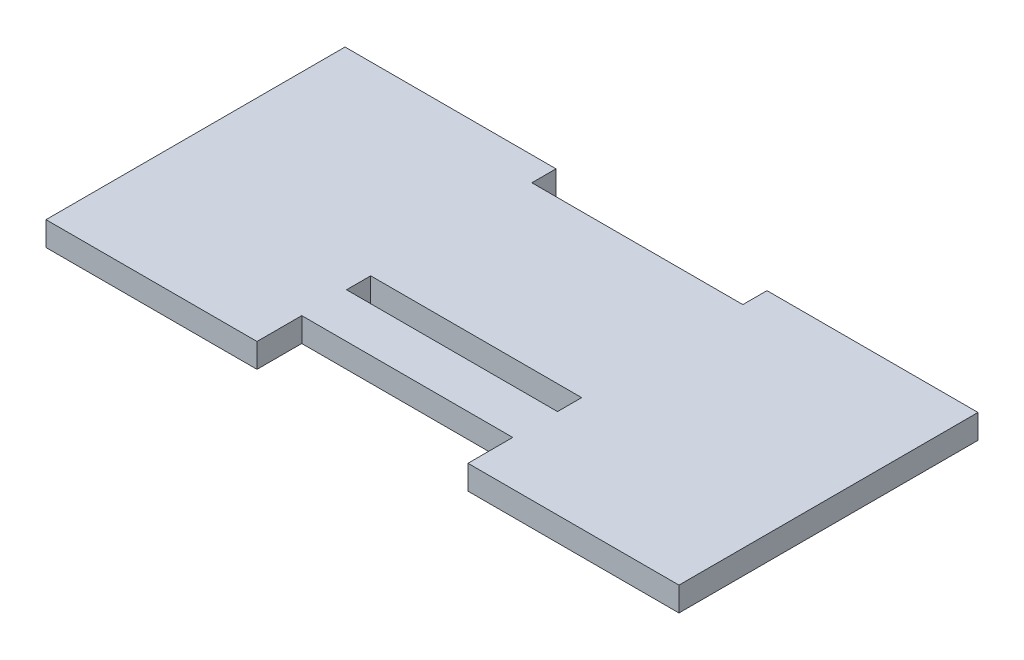
ISO-10303-21;
HEADER;
FILE_DESCRIPTION(('STEP AP214'),'2;1');
FILE_NAME('part.step','',(''),(''),'','','');
FILE_SCHEMA(('AUTOMOTIVE_DESIGN { 1 0 10303 214 1 1 1 1 }'));
ENDSEC;
DATA;
#1=APPLICATION_CONTEXT('core data for automotive mechanical design processes');
#2=APPLICATION_PROTOCOL_DEFINITION('international standard','automotive_design',2000,#1);
#3=PRODUCT_CONTEXT('',#1,'mechanical');
#4=PRODUCT('Part','Part','',(#3));
#5=PRODUCT_RELATED_PRODUCT_CATEGORY('part','',(#4));
#6=PRODUCT_DEFINITION_FORMATION('','',#4);
#7=PRODUCT_DEFINITION_CONTEXT('part definition',#1,'design');
#8=PRODUCT_DEFINITION('design','',#6,#7);
#9=PRODUCT_DEFINITION_SHAPE('','',#8);
#10=(LENGTH_UNIT() NAMED_UNIT(*) SI_UNIT(.MILLI.,.METRE.));
#11=(NAMED_UNIT(*) PLANE_ANGLE_UNIT() SI_UNIT($,.RADIAN.));
#12=(NAMED_UNIT(*) SI_UNIT($,.STERADIAN.) SOLID_ANGLE_UNIT());
#13=UNCERTAINTY_MEASURE_WITH_UNIT(LENGTH_MEASURE(1.E-05),#10,'distance_accuracy_value','');
#14=(GEOMETRIC_REPRESENTATION_CONTEXT(3) GLOBAL_UNCERTAINTY_ASSIGNED_CONTEXT((#13)) GLOBAL_UNIT_ASSIGNED_CONTEXT((#10,
#11,#12)) REPRESENTATION_CONTEXT('',''));
#15=CARTESIAN_POINT('',(0.,0.,0.));
#16=DIRECTION('',(0.,0.,1.));
#17=DIRECTION('',(1.,0.,0.));
#18=AXIS2_PLACEMENT_3D('',#15,#16,#17);
#19=CARTESIAN_POINT('',(0.,2.7,0.));
#20=DIRECTION('',(0.,-1.,0.));
#21=DIRECTION('',(0.,0.,-1.));
#22=AXIS2_PLACEMENT_3D('',#19,#20,#21);
#23=PLANE('',#22);
#24=DIRECTION('',(1.,0.,0.));
#25=VECTOR('',#24,1.);
#26=CARTESIAN_POINT('',(12.6333333333333,2.7,16.7));
#27=LINE('',#26,#25);
#28=CARTESIAN_POINT('',(12.6333333333333,2.7,16.7));
#29=VERTEX_POINT('',#28);
#30=CARTESIAN_POINT('',(36.2,2.7,16.7));
#31=VERTEX_POINT('',#30);
#32=EDGE_CURVE('E182',#29,#31,#27,.T.);
#33=ORIENTED_EDGE('',*,*,#32,.T.);
#34=DIRECTION('',(0.,0.,-1.));
#35=VECTOR('',#34,1.);
#36=CARTESIAN_POINT('',(36.2,2.7,-16.7));
#37=LINE('',#36,#35);
#38=CARTESIAN_POINT('',(36.2,2.7,-16.7));
#39=VERTEX_POINT('',#38);
#40=EDGE_CURVE('E185',#31,#39,#37,.T.);
#41=ORIENTED_EDGE('',*,*,#40,.T.);
#42=DIRECTION('',(-1.,0.,0.));
#43=VECTOR('',#42,1.);
#44=CARTESIAN_POINT('',(12.6333333333333,2.7,-16.7));
#45=LINE('',#44,#43);
#46=CARTESIAN_POINT('',(12.6333333333333,2.7,-16.7));
#47=VERTEX_POINT('',#46);
#48=EDGE_CURVE('E188',#39,#47,#45,.T.);
#49=ORIENTED_EDGE('',*,*,#48,.T.);
#50=DIRECTION('',(0.,0.,1.));
#51=VECTOR('',#50,1.);
#52=CARTESIAN_POINT('',(12.6333333333333,2.7,-16.7));
#53=LINE('',#52,#51);
#54=CARTESIAN_POINT('',(12.6333333333333,2.7,-14.));
#55=VERTEX_POINT('',#54);
#56=EDGE_CURVE('E190',#47,#55,#53,.T.);
#57=ORIENTED_EDGE('',*,*,#56,.T.);
#58=DIRECTION('',(-1.,0.,0.));
#59=VECTOR('',#58,1.);
#60=CARTESIAN_POINT('',(-10.9333333333333,2.7,-14.));
#61=LINE('',#60,#59);
#62=CARTESIAN_POINT('',(-10.9333333333333,2.7,-14.));
#63=VERTEX_POINT('',#62);
#64=EDGE_CURVE('E192',#55,#63,#61,.T.);
#65=ORIENTED_EDGE('',*,*,#64,.T.);
#66=DIRECTION('',(0.,0.,-1.));
#67=VECTOR('',#66,1.);
#68=CARTESIAN_POINT('',(-10.9333333333333,2.7,-16.7));
#69=LINE('',#68,#67);
#70=CARTESIAN_POINT('',(-10.9333333333333,2.7,-16.7));
#71=VERTEX_POINT('',#70);
#72=EDGE_CURVE('E194',#63,#71,#69,.T.);
#73=ORIENTED_EDGE('',*,*,#72,.T.);
#74=DIRECTION('',(-1.,0.,0.));
#75=VECTOR('',#74,1.);
#76=CARTESIAN_POINT('',(-34.5,2.7,-16.7));
#77=LINE('',#76,#75);
#78=CARTESIAN_POINT('',(-34.5,2.7,-16.7));
#79=VERTEX_POINT('',#78);
#80=EDGE_CURVE('E196',#71,#79,#77,.T.);
#81=ORIENTED_EDGE('',*,*,#80,.T.);
#82=DIRECTION('',(0.,0.,1.));
#83=VECTOR('',#82,1.);
#84=CARTESIAN_POINT('',(-34.5,2.7,-16.7));
#85=LINE('',#84,#83);
#86=CARTESIAN_POINT('',(-34.5,2.7,16.7));
#87=VERTEX_POINT('',#86);
#88=EDGE_CURVE('E198',#79,#87,#85,.T.);
#89=ORIENTED_EDGE('',*,*,#88,.T.);
#90=DIRECTION('',(1.,0.,0.));
#91=VECTOR('',#90,1.);
#92=CARTESIAN_POINT('',(-34.5,2.7,16.7));
#93=LINE('',#92,#91);
#94=CARTESIAN_POINT('',(-10.9333333333333,2.7,16.7));
#95=VERTEX_POINT('',#94);
#96=EDGE_CURVE('E200',#87,#95,#93,.T.);
#97=ORIENTED_EDGE('',*,*,#96,.T.);
#98=DIRECTION('',(0.,0.,-1.));
#99=VECTOR('',#98,1.);
#100=CARTESIAN_POINT('',(-10.9333333333333,2.7,11.7));
#101=LINE('',#100,#99);
#102=CARTESIAN_POINT('',(-10.9333333333333,2.7,11.7));
#103=VERTEX_POINT('',#102);
#104=EDGE_CURVE('E202',#95,#103,#101,.T.);
#105=ORIENTED_EDGE('',*,*,#104,.T.);
#106=DIRECTION('',(1.,0.,0.));
#107=VECTOR('',#106,1.);
#108=CARTESIAN_POINT('',(-10.9333333333333,2.7,11.7));
#109=LINE('',#108,#107);
#110=CARTESIAN_POINT('',(12.6333333333333,2.7,11.7));
#111=VERTEX_POINT('',#110);
#112=EDGE_CURVE('E204',#103,#111,#109,.T.);
#113=ORIENTED_EDGE('',*,*,#112,.T.);
#114=DIRECTION('',(0.,0.,1.));
#115=VECTOR('',#114,1.);
#116=CARTESIAN_POINT('',(12.6333333333333,2.7,11.7));
#117=LINE('',#116,#115);
#118=EDGE_CURVE('E206',#111,#29,#117,.T.);
#119=ORIENTED_EDGE('',*,*,#118,.T.);
#120=EDGE_LOOP('',(#33,#41,#49,#57,#65,#73,#81,#89,#97,#105,#113,#119));
#121=FACE_BOUND('',#120,.T.);
#122=DIRECTION('',(0.,0.,-1.));
#123=VECTOR('',#122,1.);
#124=CARTESIAN_POINT('',(12.6333333333333,2.7,4.));
#125=LINE('',#124,#123);
#126=CARTESIAN_POINT('',(12.6333333333333,2.7,6.7));
#127=VERTEX_POINT('',#126);
#128=CARTESIAN_POINT('',(12.6333333333333,2.7,4.));
#129=VERTEX_POINT('',#128);
#130=EDGE_CURVE('E146',#127,#129,#125,.T.);
#131=ORIENTED_EDGE('',*,*,#130,.F.);
#132=DIRECTION('',(1.,0.,0.));
#133=VECTOR('',#132,1.);
#134=CARTESIAN_POINT('',(-10.9333333333333,2.7,6.7));
#135=LINE('',#134,#133);
#136=CARTESIAN_POINT('',(-10.9333333333333,2.7,6.7));
#137=VERTEX_POINT('',#136);
#138=EDGE_CURVE('E168',#137,#127,#135,.T.);
#139=ORIENTED_EDGE('',*,*,#138,.F.);
#140=DIRECTION('',(0.,0.,1.));
#141=VECTOR('',#140,1.);
#142=CARTESIAN_POINT('',(-10.9333333333333,2.7,4.));
#143=LINE('',#142,#141);
#144=CARTESIAN_POINT('',(-10.9333333333333,2.7,4.));
#145=VERTEX_POINT('',#144);
#146=EDGE_CURVE('E166',#145,#137,#143,.T.);
#147=ORIENTED_EDGE('',*,*,#146,.F.);
#148=DIRECTION('',(-1.,0.,0.));
#149=VECTOR('',#148,1.);
#150=CARTESIAN_POINT('',(-10.9333333333333,2.7,4.));
#151=LINE('',#150,#149);
#152=EDGE_CURVE('E154',#129,#145,#151,.T.);
#153=ORIENTED_EDGE('',*,*,#152,.F.);
#154=EDGE_LOOP('',(#131,#139,#147,#153));
#155=FACE_BOUND('',#154,.T.);
#156=ADVANCED_FACE('F33',(#121,#155),#23,.F.);
#157=CARTESIAN_POINT('',(0.,0.,0.));
#158=DIRECTION('',(0.,-1.,0.));
#159=DIRECTION('',(0.,0.,-1.));
#160=AXIS2_PLACEMENT_3D('',#157,#158,#159);
#161=PLANE('',#160);
#162=DIRECTION('',(1.,0.,0.));
#163=VECTOR('',#162,1.);
#164=CARTESIAN_POINT('',(12.6333333333333,0.,16.7));
#165=LINE('',#164,#163);
#166=CARTESIAN_POINT('',(12.6333333333333,0.,16.7));
#167=VERTEX_POINT('',#166);
#168=CARTESIAN_POINT('',(36.2,0.,16.7));
#169=VERTEX_POINT('',#168);
#170=EDGE_CURVE('E162',#167,#169,#165,.T.);
#171=ORIENTED_EDGE('',*,*,#170,.F.);
#172=DIRECTION('',(0.,0.,1.));
#173=VECTOR('',#172,1.);
#174=CARTESIAN_POINT('',(12.6333333333333,0.,11.7));
#175=LINE('',#174,#173);
#176=CARTESIAN_POINT('',(12.6333333333333,0.,11.7));
#177=VERTEX_POINT('',#176);
#178=EDGE_CURVE('E186',#177,#167,#175,.T.);
#179=ORIENTED_EDGE('',*,*,#178,.F.);
#180=DIRECTION('',(1.,0.,0.));
#181=VECTOR('',#180,1.);
#182=CARTESIAN_POINT('',(-10.9333333333333,0.,11.7));
#183=LINE('',#182,#181);
#184=CARTESIAN_POINT('',(-10.9333333333333,0.,11.7));
#185=VERTEX_POINT('',#184);
#186=EDGE_CURVE('E229',#185,#177,#183,.T.);
#187=ORIENTED_EDGE('',*,*,#186,.F.);
#188=DIRECTION('',(0.,0.,-1.));
#189=VECTOR('',#188,1.);
#190=CARTESIAN_POINT('',(-10.9333333333333,0.,11.7));
#191=LINE('',#190,#189);
#192=CARTESIAN_POINT('',(-10.9333333333333,0.,16.7));
#193=VERTEX_POINT('',#192);
#194=EDGE_CURVE('E227',#193,#185,#191,.T.);
#195=ORIENTED_EDGE('',*,*,#194,.F.);
#196=DIRECTION('',(1.,0.,0.));
#197=VECTOR('',#196,1.);
#198=CARTESIAN_POINT('',(-34.5,0.,16.7));
#199=LINE('',#198,#197);
#200=CARTESIAN_POINT('',(-34.5,0.,16.7));
#201=VERTEX_POINT('',#200);
#202=EDGE_CURVE('E225',#201,#193,#199,.T.);
#203=ORIENTED_EDGE('',*,*,#202,.F.);
#204=DIRECTION('',(0.,0.,1.));
#205=VECTOR('',#204,1.);
#206=CARTESIAN_POINT('',(-34.5,0.,-16.7));
#207=LINE('',#206,#205);
#208=CARTESIAN_POINT('',(-34.5,0.,-16.7));
#209=VERTEX_POINT('',#208);
#210=EDGE_CURVE('E223',#209,#201,#207,.T.);
#211=ORIENTED_EDGE('',*,*,#210,.F.);
#212=DIRECTION('',(-1.,0.,0.));
#213=VECTOR('',#212,1.);
#214=CARTESIAN_POINT('',(-34.5,0.,-16.7));
#215=LINE('',#214,#213);
#216=CARTESIAN_POINT('',(-10.9333333333333,0.,-16.7));
#217=VERTEX_POINT('',#216);
#218=EDGE_CURVE('E221',#217,#209,#215,.T.);
#219=ORIENTED_EDGE('',*,*,#218,.F.);
#220=DIRECTION('',(0.,0.,-1.));
#221=VECTOR('',#220,1.);
#222=CARTESIAN_POINT('',(-10.9333333333333,0.,-16.7));
#223=LINE('',#222,#221);
#224=CARTESIAN_POINT('',(-10.9333333333333,0.,-14.));
#225=VERTEX_POINT('',#224);
#226=EDGE_CURVE('E219',#225,#217,#223,.T.);
#227=ORIENTED_EDGE('',*,*,#226,.F.);
#228=DIRECTION('',(-1.,0.,0.));
#229=VECTOR('',#228,1.);
#230=CARTESIAN_POINT('',(-10.9333333333333,0.,-14.));
#231=LINE('',#230,#229);
#232=CARTESIAN_POINT('',(12.6333333333333,0.,-14.));
#233=VERTEX_POINT('',#232);
#234=EDGE_CURVE('E217',#233,#225,#231,.T.);
#235=ORIENTED_EDGE('',*,*,#234,.F.);
#236=DIRECTION('',(0.,0.,1.));
#237=VECTOR('',#236,1.);
#238=CARTESIAN_POINT('',(12.6333333333333,0.,-16.7));
#239=LINE('',#238,#237);
#240=CARTESIAN_POINT('',(12.6333333333333,0.,-16.7));
#241=VERTEX_POINT('',#240);
#242=EDGE_CURVE('E215',#241,#233,#239,.T.);
#243=ORIENTED_EDGE('',*,*,#242,.F.);
#244=DIRECTION('',(-1.,0.,0.));
#245=VECTOR('',#244,1.);
#246=CARTESIAN_POINT('',(12.6333333333333,0.,-16.7));
#247=LINE('',#246,#245);
#248=CARTESIAN_POINT('',(36.2,0.,-16.7));
#249=VERTEX_POINT('',#248);
#250=EDGE_CURVE('E213',#249,#241,#247,.T.);
#251=ORIENTED_EDGE('',*,*,#250,.F.);
#252=DIRECTION('',(0.,0.,-1.));
#253=VECTOR('',#252,1.);
#254=CARTESIAN_POINT('',(36.2,0.,-16.7));
#255=LINE('',#254,#253);
#256=EDGE_CURVE('E211',#169,#249,#255,.T.);
#257=ORIENTED_EDGE('',*,*,#256,.F.);
#258=EDGE_LOOP('',(#171,#179,#187,#195,#203,#211,#219,#227,#235,#243,#251,#257));
#259=FACE_BOUND('',#258,.T.);
#260=DIRECTION('',(1.,0.,0.));
#261=VECTOR('',#260,1.);
#262=CARTESIAN_POINT('',(-10.9333333333333,0.,6.7));
#263=LINE('',#262,#261);
#264=CARTESIAN_POINT('',(-10.9333333333333,0.,6.7));
#265=VERTEX_POINT('',#264);
#266=CARTESIAN_POINT('',(12.6333333333333,0.,6.7));
#267=VERTEX_POINT('',#266);
#268=EDGE_CURVE('E155',#265,#267,#263,.T.);
#269=ORIENTED_EDGE('',*,*,#268,.T.);
#270=DIRECTION('',(0.,0.,-1.));
#271=VECTOR('',#270,1.);
#272=CARTESIAN_POINT('',(12.6333333333333,0.,4.));
#273=LINE('',#272,#271);
#274=CARTESIAN_POINT('',(12.6333333333333,0.,4.));
#275=VERTEX_POINT('',#274);
#276=EDGE_CURVE('E56',#267,#275,#273,.T.);
#277=ORIENTED_EDGE('',*,*,#276,.T.);
#278=DIRECTION('',(-1.,0.,0.));
#279=VECTOR('',#278,1.);
#280=CARTESIAN_POINT('',(-10.9333333333333,0.,4.));
#281=LINE('',#280,#279);
#282=CARTESIAN_POINT('',(-10.9333333333333,0.,4.));
#283=VERTEX_POINT('',#282);
#284=EDGE_CURVE('E161',#275,#283,#281,.T.);
#285=ORIENTED_EDGE('',*,*,#284,.T.);
#286=DIRECTION('',(0.,0.,1.));
#287=VECTOR('',#286,1.);
#288=CARTESIAN_POINT('',(-10.9333333333333,0.,4.));
#289=LINE('',#288,#287);
#290=EDGE_CURVE('E174',#283,#265,#289,.T.);
#291=ORIENTED_EDGE('',*,*,#290,.T.);
#292=EDGE_LOOP('',(#269,#277,#285,#291));
#293=FACE_BOUND('',#292,.T.);
#294=ADVANCED_FACE('F271',(#259,#293),#161,.T.);
#295=CARTESIAN_POINT('',(12.6333333333333,2.7,16.7));
#296=DIRECTION('',(0.,0.,-1.));
#297=DIRECTION('',(-1.,0.,0.));
#298=AXIS2_PLACEMENT_3D('',#295,#296,#297);
#299=PLANE('',#298);
#300=ORIENTED_EDGE('',*,*,#170,.T.);
#301=DIRECTION('',(0.,-1.,0.));
#302=VECTOR('',#301,1.);
#303=CARTESIAN_POINT('',(36.2,2.7,16.7));
#304=LINE('',#303,#302);
#305=EDGE_CURVE('E11',#31,#169,#304,.T.);
#306=ORIENTED_EDGE('',*,*,#305,.F.);
#307=ORIENTED_EDGE('',*,*,#32,.F.);
#308=DIRECTION('',(0.,-1.,0.));
#309=VECTOR('',#308,1.);
#310=CARTESIAN_POINT('',(12.6333333333333,2.7,16.7));
#311=LINE('',#310,#309);
#312=EDGE_CURVE('E208',#29,#167,#311,.T.);
#313=ORIENTED_EDGE('',*,*,#312,.T.);
#314=EDGE_LOOP('',(#300,#306,#307,#313));
#315=FACE_BOUND('',#314,.T.);
#316=ADVANCED_FACE('F35',(#315),#299,.F.);
#317=CARTESIAN_POINT('',(36.2,2.7,-16.7));
#318=DIRECTION('',(-1.,0.,0.));
#319=DIRECTION('',(0.,0.,1.));
#320=AXIS2_PLACEMENT_3D('',#317,#318,#319);
#321=PLANE('',#320);
#322=ORIENTED_EDGE('',*,*,#256,.T.);
#323=DIRECTION('',(0.,-1.,0.));
#324=VECTOR('',#323,1.);
#325=CARTESIAN_POINT('',(36.2,2.7,-16.7));
#326=LINE('',#325,#324);
#327=EDGE_CURVE('E41',#39,#249,#326,.T.);
#328=ORIENTED_EDGE('',*,*,#327,.F.);
#329=ORIENTED_EDGE('',*,*,#40,.F.);
#330=ORIENTED_EDGE('',*,*,#305,.T.);
#331=EDGE_LOOP('',(#322,#328,#329,#330));
#332=FACE_BOUND('',#331,.T.);
#333=ADVANCED_FACE('F288',(#332),#321,.F.);
#334=CARTESIAN_POINT('',(12.6333333333333,2.7,-16.7));
#335=DIRECTION('',(0.,0.,1.));
#336=DIRECTION('',(1.,0.,0.));
#337=AXIS2_PLACEMENT_3D('',#334,#335,#336);
#338=PLANE('',#337);
#339=ORIENTED_EDGE('',*,*,#250,.T.);
#340=DIRECTION('',(0.,-1.,0.));
#341=VECTOR('',#340,1.);
#342=CARTESIAN_POINT('',(12.6333333333333,2.7,-16.7));
#343=LINE('',#342,#341);
#344=EDGE_CURVE('E258',#47,#241,#343,.T.);
#345=ORIENTED_EDGE('',*,*,#344,.F.);
#346=ORIENTED_EDGE('',*,*,#48,.F.);
#347=ORIENTED_EDGE('',*,*,#327,.T.);
#348=EDGE_LOOP('',(#339,#345,#346,#347));
#349=FACE_BOUND('',#348,.T.);
#350=ADVANCED_FACE('F265',(#349),#338,.F.);
#351=CARTESIAN_POINT('',(12.6333333333333,2.7,-16.7));
#352=DIRECTION('',(1.,0.,0.));
#353=DIRECTION('',(0.,0.,-1.));
#354=AXIS2_PLACEMENT_3D('',#351,#352,#353);
#355=PLANE('',#354);
#356=ORIENTED_EDGE('',*,*,#242,.T.);
#357=DIRECTION('',(0.,-1.,0.));
#358=VECTOR('',#357,1.);
#359=CARTESIAN_POINT('',(12.6333333333333,2.7,-14.));
#360=LINE('',#359,#358);
#361=EDGE_CURVE('E255',#55,#233,#360,.T.);
#362=ORIENTED_EDGE('',*,*,#361,.F.);
#363=ORIENTED_EDGE('',*,*,#56,.F.);
#364=ORIENTED_EDGE('',*,*,#344,.T.);
#365=EDGE_LOOP('',(#356,#362,#363,#364));
#366=FACE_BOUND('',#365,.T.);
#367=ADVANCED_FACE('F277',(#366),#355,.F.);
#368=CARTESIAN_POINT('',(-10.9333333333333,2.7,-14.));
#369=DIRECTION('',(0.,0.,1.));
#370=DIRECTION('',(1.,0.,0.));
#371=AXIS2_PLACEMENT_3D('',#368,#369,#370);
#372=PLANE('',#371);
#373=ORIENTED_EDGE('',*,*,#234,.T.);
#374=DIRECTION('',(0.,-1.,0.));
#375=VECTOR('',#374,1.);
#376=CARTESIAN_POINT('',(-10.9333333333333,2.7,-14.));
#377=LINE('',#376,#375);
#378=EDGE_CURVE('E252',#63,#225,#377,.T.);
#379=ORIENTED_EDGE('',*,*,#378,.F.);
#380=ORIENTED_EDGE('',*,*,#64,.F.);
#381=ORIENTED_EDGE('',*,*,#361,.T.);
#382=EDGE_LOOP('',(#373,#379,#380,#381));
#383=FACE_BOUND('',#382,.T.);
#384=ADVANCED_FACE('F281',(#383),#372,.F.);
#385=CARTESIAN_POINT('',(-10.9333333333333,2.7,-16.7));
#386=DIRECTION('',(-1.,0.,0.));
#387=DIRECTION('',(0.,0.,1.));
#388=AXIS2_PLACEMENT_3D('',#385,#386,#387);
#389=PLANE('',#388);
#390=ORIENTED_EDGE('',*,*,#226,.T.);
#391=DIRECTION('',(0.,-1.,0.));
#392=VECTOR('',#391,1.);
#393=CARTESIAN_POINT('',(-10.9333333333333,2.7,-16.7));
#394=LINE('',#393,#392);
#395=EDGE_CURVE('E249',#71,#217,#394,.T.);
#396=ORIENTED_EDGE('',*,*,#395,.F.);
#397=ORIENTED_EDGE('',*,*,#72,.F.);
#398=ORIENTED_EDGE('',*,*,#378,.T.);
#399=EDGE_LOOP('',(#390,#396,#397,#398));
#400=FACE_BOUND('',#399,.T.);
#401=ADVANCED_FACE('F321',(#400),#389,.F.);
#402=CARTESIAN_POINT('',(-34.5,2.7,-16.7));
#403=DIRECTION('',(0.,0.,1.));
#404=DIRECTION('',(1.,0.,0.));
#405=AXIS2_PLACEMENT_3D('',#402,#403,#404);
#406=PLANE('',#405);
#407=ORIENTED_EDGE('',*,*,#218,.T.);
#408=DIRECTION('',(0.,-1.,0.));
#409=VECTOR('',#408,1.);
#410=CARTESIAN_POINT('',(-34.5,2.7,-16.7));
#411=LINE('',#410,#409);
#412=EDGE_CURVE('E246',#79,#209,#411,.T.);
#413=ORIENTED_EDGE('',*,*,#412,.F.);
#414=ORIENTED_EDGE('',*,*,#80,.F.);
#415=ORIENTED_EDGE('',*,*,#395,.T.);
#416=EDGE_LOOP('',(#407,#413,#414,#415));
#417=FACE_BOUND('',#416,.T.);
#418=ADVANCED_FACE('F319',(#417),#406,.F.);
#419=CARTESIAN_POINT('',(-34.5,2.7,-16.7));
#420=DIRECTION('',(1.,0.,0.));
#421=DIRECTION('',(0.,0.,-1.));
#422=AXIS2_PLACEMENT_3D('',#419,#420,#421);
#423=PLANE('',#422);
#424=ORIENTED_EDGE('',*,*,#210,.T.);
#425=DIRECTION('',(0.,-1.,0.));
#426=VECTOR('',#425,1.);
#427=CARTESIAN_POINT('',(-34.5,2.7,16.7));
#428=LINE('',#427,#426);
#429=EDGE_CURVE('E243',#87,#201,#428,.T.);
#430=ORIENTED_EDGE('',*,*,#429,.F.);
#431=ORIENTED_EDGE('',*,*,#88,.F.);
#432=ORIENTED_EDGE('',*,*,#412,.T.);
#433=EDGE_LOOP('',(#424,#430,#431,#432));
#434=FACE_BOUND('',#433,.T.);
#435=ADVANCED_FACE('F315',(#434),#423,.F.);
#436=CARTESIAN_POINT('',(-34.5,2.7,16.7));
#437=DIRECTION('',(0.,0.,-1.));
#438=DIRECTION('',(-1.,0.,0.));
#439=AXIS2_PLACEMENT_3D('',#436,#437,#438);
#440=PLANE('',#439);
#441=ORIENTED_EDGE('',*,*,#202,.T.);
#442=DIRECTION('',(0.,-1.,0.));
#443=VECTOR('',#442,1.);
#444=CARTESIAN_POINT('',(-10.9333333333333,2.7,16.7));
#445=LINE('',#444,#443);
#446=EDGE_CURVE('E240',#95,#193,#445,.T.);
#447=ORIENTED_EDGE('',*,*,#446,.F.);
#448=ORIENTED_EDGE('',*,*,#96,.F.);
#449=ORIENTED_EDGE('',*,*,#429,.T.);
#450=EDGE_LOOP('',(#441,#447,#448,#449));
#451=FACE_BOUND('',#450,.T.);
#452=ADVANCED_FACE('F310',(#451),#440,.F.);
#453=CARTESIAN_POINT('',(-10.9333333333333,2.7,11.7));
#454=DIRECTION('',(-1.,0.,0.));
#455=DIRECTION('',(0.,0.,1.));
#456=AXIS2_PLACEMENT_3D('',#453,#454,#455);
#457=PLANE('',#456);
#458=ORIENTED_EDGE('',*,*,#194,.T.);
#459=DIRECTION('',(0.,-1.,0.));
#460=VECTOR('',#459,1.);
#461=CARTESIAN_POINT('',(-10.9333333333333,2.7,11.7));
#462=LINE('',#461,#460);
#463=EDGE_CURVE('E237',#103,#185,#462,.T.);
#464=ORIENTED_EDGE('',*,*,#463,.F.);
#465=ORIENTED_EDGE('',*,*,#104,.F.);
#466=ORIENTED_EDGE('',*,*,#446,.T.);
#467=EDGE_LOOP('',(#458,#464,#465,#466));
#468=FACE_BOUND('',#467,.T.);
#469=ADVANCED_FACE('F304',(#468),#457,.F.);
#470=CARTESIAN_POINT('',(-10.9333333333333,2.7,11.7));
#471=DIRECTION('',(0.,0.,-1.));
#472=DIRECTION('',(-1.,0.,0.));
#473=AXIS2_PLACEMENT_3D('',#470,#471,#472);
#474=PLANE('',#473);
#475=ORIENTED_EDGE('',*,*,#186,.T.);
#476=DIRECTION('',(0.,-1.,0.));
#477=VECTOR('',#476,1.);
#478=CARTESIAN_POINT('',(12.6333333333333,2.7,11.7));
#479=LINE('',#478,#477);
#480=EDGE_CURVE('E234',#111,#177,#479,.T.);
#481=ORIENTED_EDGE('',*,*,#480,.F.);
#482=ORIENTED_EDGE('',*,*,#112,.F.);
#483=ORIENTED_EDGE('',*,*,#463,.T.);
#484=EDGE_LOOP('',(#475,#481,#482,#483));
#485=FACE_BOUND('',#484,.T.);
#486=ADVANCED_FACE('F300',(#485),#474,.F.);
#487=CARTESIAN_POINT('',(12.6333333333333,2.7,11.7));
#488=DIRECTION('',(1.,0.,0.));
#489=DIRECTION('',(0.,0.,-1.));
#490=AXIS2_PLACEMENT_3D('',#487,#488,#489);
#491=PLANE('',#490);
#492=ORIENTED_EDGE('',*,*,#178,.T.);
#493=ORIENTED_EDGE('',*,*,#312,.F.);
#494=ORIENTED_EDGE('',*,*,#118,.F.);
#495=ORIENTED_EDGE('',*,*,#480,.T.);
#496=EDGE_LOOP('',(#492,#493,#494,#495));
#497=FACE_BOUND('',#496,.T.);
#498=ADVANCED_FACE('F295',(#497),#491,.F.);
#499=CARTESIAN_POINT('',(12.6333333333333,2.7,4.));
#500=DIRECTION('',(-1.,0.,0.));
#501=DIRECTION('',(0.,0.,1.));
#502=AXIS2_PLACEMENT_3D('',#499,#500,#501);
#503=PLANE('',#502);
#504=ORIENTED_EDGE('',*,*,#276,.F.);
#505=DIRECTION('',(0.,-1.,0.));
#506=VECTOR('',#505,1.);
#507=CARTESIAN_POINT('',(12.6333333333333,2.7,6.7));
#508=LINE('',#507,#506);
#509=EDGE_CURVE('E150',#127,#267,#508,.T.);
#510=ORIENTED_EDGE('',*,*,#509,.F.);
#511=ORIENTED_EDGE('',*,*,#130,.T.);
#512=DIRECTION('',(0.,-1.,0.));
#513=VECTOR('',#512,1.);
#514=CARTESIAN_POINT('',(12.6333333333333,2.7,4.));
#515=LINE('',#514,#513);
#516=EDGE_CURVE('E149',#129,#275,#515,.T.);
#517=ORIENTED_EDGE('',*,*,#516,.T.);
#518=EDGE_LOOP('',(#504,#510,#511,#517));
#519=FACE_BOUND('',#518,.T.);
#520=ADVANCED_FACE('F148',(#519),#503,.T.);
#521=CARTESIAN_POINT('',(-10.9333333333333,2.7,4.));
#522=DIRECTION('',(0.,0.,1.));
#523=DIRECTION('',(1.,0.,0.));
#524=AXIS2_PLACEMENT_3D('',#521,#522,#523);
#525=PLANE('',#524);
#526=ORIENTED_EDGE('',*,*,#284,.F.);
#527=ORIENTED_EDGE('',*,*,#516,.F.);
#528=ORIENTED_EDGE('',*,*,#152,.T.);
#529=DIRECTION('',(0.,-1.,0.));
#530=VECTOR('',#529,1.);
#531=CARTESIAN_POINT('',(-10.9333333333333,2.7,4.));
#532=LINE('',#531,#530);
#533=EDGE_CURVE('E163',#145,#283,#532,.T.);
#534=ORIENTED_EDGE('',*,*,#533,.T.);
#535=EDGE_LOOP('',(#526,#527,#528,#534));
#536=FACE_BOUND('',#535,.T.);
#537=ADVANCED_FACE('F158',(#536),#525,.T.);
#538=CARTESIAN_POINT('',(-10.9333333333333,2.7,4.));
#539=DIRECTION('',(1.,0.,0.));
#540=DIRECTION('',(0.,0.,-1.));
#541=AXIS2_PLACEMENT_3D('',#538,#539,#540);
#542=PLANE('',#541);
#543=ORIENTED_EDGE('',*,*,#290,.F.);
#544=ORIENTED_EDGE('',*,*,#533,.F.);
#545=ORIENTED_EDGE('',*,*,#146,.T.);
#546=DIRECTION('',(0.,-1.,0.));
#547=VECTOR('',#546,1.);
#548=CARTESIAN_POINT('',(-10.9333333333333,2.7,6.7));
#549=LINE('',#548,#547);
#550=EDGE_CURVE('E48',#137,#265,#549,.T.);
#551=ORIENTED_EDGE('',*,*,#550,.T.);
#552=EDGE_LOOP('',(#543,#544,#545,#551));
#553=FACE_BOUND('',#552,.T.);
#554=ADVANCED_FACE('F379',(#553),#542,.T.);
#555=CARTESIAN_POINT('',(-10.9333333333333,2.7,6.7));
#556=DIRECTION('',(0.,0.,-1.));
#557=DIRECTION('',(-1.,0.,0.));
#558=AXIS2_PLACEMENT_3D('',#555,#556,#557);
#559=PLANE('',#558);
#560=ORIENTED_EDGE('',*,*,#268,.F.);
#561=ORIENTED_EDGE('',*,*,#550,.F.);
#562=ORIENTED_EDGE('',*,*,#138,.T.);
#563=ORIENTED_EDGE('',*,*,#509,.T.);
#564=EDGE_LOOP('',(#560,#561,#562,#563));
#565=FACE_BOUND('',#564,.T.);
#566=ADVANCED_FACE('F385',(#565),#559,.T.);
#567=CLOSED_SHELL('',(#156,#294,#316,#333,#350,#367,#384,#401,#418,#435,#452,#469,#486,#498,
#520,#537,#554,#566));
#568=MANIFOLD_SOLID_BREP('B2',#567);
#569=ADVANCED_BREP_SHAPE_REPRESENTATION('',(#18,#568),#14);
#570=SHAPE_DEFINITION_REPRESENTATION(#9,#569);
ENDSEC;
END-ISO-10303-21;
